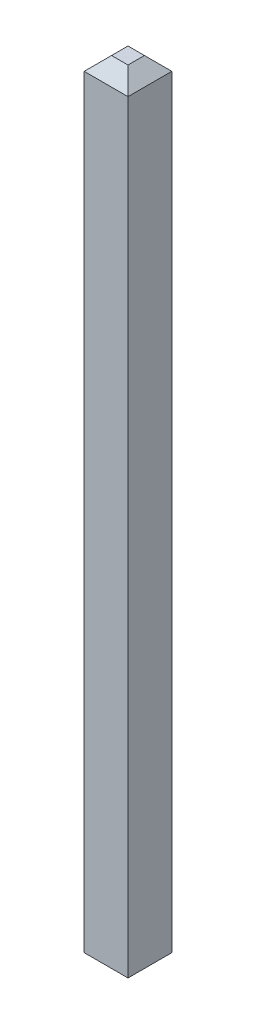
ISO-10303-21;
HEADER;
FILE_DESCRIPTION(('STEP AP214'),'2;1');
FILE_NAME('part.step','',(''),(''),'','','');
FILE_SCHEMA(('AUTOMOTIVE_DESIGN { 1 0 10303 214 1 1 1 1 }'));
ENDSEC;
DATA;
#1=APPLICATION_CONTEXT('core data for automotive mechanical design processes');
#2=APPLICATION_PROTOCOL_DEFINITION('international standard','automotive_design',2000,#1);
#3=PRODUCT_CONTEXT('',#1,'mechanical');
#4=PRODUCT('Part','Part','',(#3));
#5=PRODUCT_RELATED_PRODUCT_CATEGORY('part','',(#4));
#6=PRODUCT_DEFINITION_FORMATION('','',#4);
#7=PRODUCT_DEFINITION_CONTEXT('part definition',#1,'design');
#8=PRODUCT_DEFINITION('design','',#6,#7);
#9=PRODUCT_DEFINITION_SHAPE('','',#8);
#10=(LENGTH_UNIT() NAMED_UNIT(*) SI_UNIT(.MILLI.,.METRE.));
#11=(NAMED_UNIT(*) PLANE_ANGLE_UNIT() SI_UNIT($,.RADIAN.));
#12=(NAMED_UNIT(*) SI_UNIT($,.STERADIAN.) SOLID_ANGLE_UNIT());
#13=UNCERTAINTY_MEASURE_WITH_UNIT(LENGTH_MEASURE(1.E-05),#10,'distance_accuracy_value','');
#14=(GEOMETRIC_REPRESENTATION_CONTEXT(3) GLOBAL_UNCERTAINTY_ASSIGNED_CONTEXT((#13)) GLOBAL_UNIT_ASSIGNED_CONTEXT((#10,
#11,#12)) REPRESENTATION_CONTEXT('',''));
#15=CARTESIAN_POINT('',(0.,0.,0.));
#16=DIRECTION('',(0.,0.,1.));
#17=DIRECTION('',(1.,0.,0.));
#18=AXIS2_PLACEMENT_3D('',#15,#16,#17);
#19=CARTESIAN_POINT('',(6.47,-4.27,-0.32));
#20=DIRECTION('',(-0.707106781186548,0.707106781186548,0.));
#21=DIRECTION('',(-0.707106781186548,-0.707106781186548,0.));
#22=AXIS2_PLACEMENT_3D('',#19,#20,#21);
#23=PLANE('',#22);
#24=DIRECTION('',(0.,0.,1.));
#25=VECTOR('',#24,1.);
#26=CARTESIAN_POINT('',(6.67000000000001,-4.07,-0.32));
#27=LINE('',#26,#25);
#28=CARTESIAN_POINT('',(6.67,-4.07,-0.32));
#29=VERTEX_POINT('',#28);
#30=CARTESIAN_POINT('',(6.67,-4.07,0.32));
#31=VERTEX_POINT('',#30);
#32=EDGE_CURVE('E119',#29,#31,#27,.T.);
#33=ORIENTED_EDGE('',*,*,#32,.T.);
#34=DIRECTION('',(-0.577350269189626,-0.577350269189626,-0.577350269189626));
#35=VECTOR('',#34,1.);
#36=CARTESIAN_POINT('',(6.67,-4.07,0.32));
#37=LINE('',#36,#35);
#38=CARTESIAN_POINT('',(6.47,-4.27,0.12));
#39=VERTEX_POINT('',#38);
#40=EDGE_CURVE('E95',#31,#39,#37,.T.);
#41=ORIENTED_EDGE('',*,*,#40,.T.);
#42=DIRECTION('',(0.,0.,1.));
#43=VECTOR('',#42,1.);
#44=CARTESIAN_POINT('',(6.47,-4.27,-0.32));
#45=LINE('',#44,#43);
#46=CARTESIAN_POINT('',(6.47,-4.27,-0.12));
#47=VERTEX_POINT('',#46);
#48=EDGE_CURVE('E20',#39,#47,#45,.F.);
#49=ORIENTED_EDGE('',*,*,#48,.T.);
#50=DIRECTION('',(-0.577350269189626,-0.577350269189626,0.577350269189625));
#51=VECTOR('',#50,1.);
#52=CARTESIAN_POINT('',(6.67,-4.07,-0.32));
#53=LINE('',#52,#51);
#54=EDGE_CURVE('E84',#29,#47,#53,.T.);
#55=ORIENTED_EDGE('',*,*,#54,.F.);
#56=EDGE_LOOP('',(#33,#41,#49,#55));
#57=FACE_BOUND('',#56,.T.);
#58=ADVANCED_FACE('F17',(#57),#23,.F.);
#59=CARTESIAN_POINT('',(6.67,7.07,-0.32));
#60=DIRECTION('',(-0.707106781186548,-0.707106781186548,0.));
#61=DIRECTION('',(0.707106781186548,-0.707106781186548,0.));
#62=AXIS2_PLACEMENT_3D('',#59,#60,#61);
#63=PLANE('',#62);
#64=DIRECTION('',(0.,0.,1.));
#65=VECTOR('',#64,1.);
#66=CARTESIAN_POINT('',(6.67,7.07,-0.32));
#67=LINE('',#66,#65);
#68=CARTESIAN_POINT('',(6.67,7.07,0.32));
#69=VERTEX_POINT('',#68);
#70=CARTESIAN_POINT('',(6.67,7.07,-0.319999999999999));
#71=VERTEX_POINT('',#70);
#72=EDGE_CURVE('E121',#69,#71,#67,.F.);
#73=ORIENTED_EDGE('',*,*,#72,.T.);
#74=DIRECTION('',(0.577350269189627,-0.577350269189627,-0.577350269189624));
#75=VECTOR('',#74,1.);
#76=CARTESIAN_POINT('',(6.47,7.27,-0.12));
#77=LINE('',#76,#75);
#78=CARTESIAN_POINT('',(6.47,7.27,-0.12));
#79=VERTEX_POINT('',#78);
#80=EDGE_CURVE('E78',#79,#71,#77,.T.);
#81=ORIENTED_EDGE('',*,*,#80,.F.);
#82=DIRECTION('',(0.,0.,1.));
#83=VECTOR('',#82,1.);
#84=CARTESIAN_POINT('',(6.47,7.27,-0.32));
#85=LINE('',#84,#83);
#86=CARTESIAN_POINT('',(6.47,7.27,0.12));
#87=VERTEX_POINT('',#86);
#88=EDGE_CURVE('E108',#79,#87,#85,.T.);
#89=ORIENTED_EDGE('',*,*,#88,.T.);
#90=DIRECTION('',(0.577350269189627,-0.577350269189627,0.577350269189624));
#91=VECTOR('',#90,1.);
#92=CARTESIAN_POINT('',(6.47,7.27,0.119999999999999));
#93=LINE('',#92,#91);
#94=EDGE_CURVE('E116',#87,#69,#93,.T.);
#95=ORIENTED_EDGE('',*,*,#94,.T.);
#96=EDGE_LOOP('',(#73,#81,#89,#95));
#97=FACE_BOUND('',#96,.T.);
#98=ADVANCED_FACE('F214',(#97),#63,.F.);
#99=CARTESIAN_POINT('',(6.67,-4.27,-0.32));
#100=DIRECTION('',(0.,1.,0.));
#101=DIRECTION('',(0.,0.,1.));
#102=AXIS2_PLACEMENT_3D('',#99,#100,#101);
#103=PLANE('',#102);
#104=DIRECTION('',(1.,0.,0.));
#105=VECTOR('',#104,1.);
#106=CARTESIAN_POINT('',(6.67,-4.27,0.12));
#107=LINE('',#106,#105);
#108=CARTESIAN_POINT('',(6.23,-4.27,0.12));
#109=VERTEX_POINT('',#108);
#110=EDGE_CURVE('E110',#39,#109,#107,.F.);
#111=ORIENTED_EDGE('',*,*,#110,.T.);
#112=DIRECTION('',(0.,0.,1.));
#113=VECTOR('',#112,1.);
#114=CARTESIAN_POINT('',(6.23,-4.27,-0.32));
#115=LINE('',#114,#113);
#116=CARTESIAN_POINT('',(6.23,-4.27,-0.12));
#117=VERTEX_POINT('',#116);
#118=EDGE_CURVE('E101',#109,#117,#115,.F.);
#119=ORIENTED_EDGE('',*,*,#118,.T.);
#120=DIRECTION('',(1.,0.,0.));
#121=VECTOR('',#120,1.);
#122=CARTESIAN_POINT('',(6.35,-4.27,-0.12));
#123=LINE('',#122,#121);
#124=EDGE_CURVE('E89',#47,#117,#123,.F.);
#125=ORIENTED_EDGE('',*,*,#124,.F.);
#126=ORIENTED_EDGE('',*,*,#48,.F.);
#127=EDGE_LOOP('',(#111,#119,#125,#126));
#128=FACE_BOUND('',#127,.T.);
#129=ADVANCED_FACE('F99',(#128),#103,.F.);
#130=CARTESIAN_POINT('',(6.35,-4.07,-0.32));
#131=DIRECTION('',(0.,-0.707106781186548,-0.707106781186548));
#132=DIRECTION('',(0.,0.707106781186548,-0.707106781186548));
#133=AXIS2_PLACEMENT_3D('',#130,#131,#132);
#134=PLANE('',#133);
#135=ORIENTED_EDGE('',*,*,#54,.T.);
#136=ORIENTED_EDGE('',*,*,#124,.T.);
#137=DIRECTION('',(-0.577350269189625,0.577350269189625,-0.577350269189627));
#138=VECTOR('',#137,1.);
#139=CARTESIAN_POINT('',(6.23,-4.27,-0.12));
#140=LINE('',#139,#138);
#141=CARTESIAN_POINT('',(6.03,-4.07,-0.32));
#142=VERTEX_POINT('',#141);
#143=EDGE_CURVE('E127',#117,#142,#140,.T.);
#144=ORIENTED_EDGE('',*,*,#143,.T.);
#145=DIRECTION('',(-1.,0.,0.));
#146=VECTOR('',#145,1.);
#147=CARTESIAN_POINT('',(6.35,-4.07,-0.320000000000001));
#148=LINE('',#147,#146);
#149=EDGE_CURVE('E91',#29,#142,#148,.T.);
#150=ORIENTED_EDGE('',*,*,#149,.F.);
#151=EDGE_LOOP('',(#135,#136,#144,#150));
#152=FACE_BOUND('',#151,.T.);
#153=ADVANCED_FACE('F86',(#152),#134,.T.);
#154=CARTESIAN_POINT('',(6.35,7.07,-0.32));
#155=DIRECTION('',(0.,0.707106781186548,-0.707106781186548));
#156=DIRECTION('',(0.,0.707106781186548,0.707106781186548));
#157=AXIS2_PLACEMENT_3D('',#154,#155,#156);
#158=PLANE('',#157);
#159=ORIENTED_EDGE('',*,*,#80,.T.);
#160=DIRECTION('',(-1.,0.,0.));
#161=VECTOR('',#160,1.);
#162=CARTESIAN_POINT('',(6.35,7.07,-0.319999999999999));
#163=LINE('',#162,#161);
#164=CARTESIAN_POINT('',(6.03,7.07,-0.32));
#165=VERTEX_POINT('',#164);
#166=EDGE_CURVE('E129',#165,#71,#163,.F.);
#167=ORIENTED_EDGE('',*,*,#166,.F.);
#168=DIRECTION('',(0.577350269189625,0.577350269189625,0.577350269189627));
#169=VECTOR('',#168,1.);
#170=CARTESIAN_POINT('',(6.03,7.07,-0.32));
#171=LINE('',#170,#169);
#172=CARTESIAN_POINT('',(6.23,7.27,-0.120000000000001));
#173=VERTEX_POINT('',#172);
#174=EDGE_CURVE('E136',#165,#173,#171,.T.);
#175=ORIENTED_EDGE('',*,*,#174,.T.);
#176=DIRECTION('',(1.,0.,0.));
#177=VECTOR('',#176,1.);
#178=CARTESIAN_POINT('',(6.03,7.27,-0.12));
#179=LINE('',#178,#177);
#180=EDGE_CURVE('E103',#173,#79,#179,.T.);
#181=ORIENTED_EDGE('',*,*,#180,.T.);
#182=EDGE_LOOP('',(#159,#167,#175,#181));
#183=FACE_BOUND('',#182,.T.);
#184=ADVANCED_FACE('F206',(#183),#158,.T.);
#185=CARTESIAN_POINT('',(6.03,7.27,-0.32));
#186=DIRECTION('',(0.,-1.,0.));
#187=DIRECTION('',(1.,0.,0.));
#188=AXIS2_PLACEMENT_3D('',#185,#186,#187);
#189=PLANE('',#188);
#190=ORIENTED_EDGE('',*,*,#180,.F.);
#191=DIRECTION('',(0.,0.,1.));
#192=VECTOR('',#191,1.);
#193=CARTESIAN_POINT('',(6.23,7.27,-0.32));
#194=LINE('',#193,#192);
#195=CARTESIAN_POINT('',(6.23,7.27,0.12));
#196=VERTEX_POINT('',#195);
#197=EDGE_CURVE('E139',#173,#196,#194,.T.);
#198=ORIENTED_EDGE('',*,*,#197,.T.);
#199=DIRECTION('',(1.,0.,0.));
#200=VECTOR('',#199,1.);
#201=CARTESIAN_POINT('',(6.03,7.27,0.12));
#202=LINE('',#201,#200);
#203=EDGE_CURVE('E113',#196,#87,#202,.T.);
#204=ORIENTED_EDGE('',*,*,#203,.T.);
#205=ORIENTED_EDGE('',*,*,#88,.F.);
#206=EDGE_LOOP('',(#190,#198,#204,#205));
#207=FACE_BOUND('',#206,.T.);
#208=ADVANCED_FACE('F203',(#207),#189,.F.);
#209=CARTESIAN_POINT('',(6.67,-4.27,0.12));
#210=DIRECTION('',(0.,0.707106781186548,-0.707106781186548));
#211=DIRECTION('',(0.,0.707106781186548,0.707106781186548));
#212=AXIS2_PLACEMENT_3D('',#209,#210,#211);
#213=PLANE('',#212);
#214=DIRECTION('',(-1.,0.,0.));
#215=VECTOR('',#214,1.);
#216=CARTESIAN_POINT('',(6.35,-4.07,0.319999999999999));
#217=LINE('',#216,#215);
#218=CARTESIAN_POINT('',(6.03,-4.07,0.32));
#219=VERTEX_POINT('',#218);
#220=EDGE_CURVE('E144',#31,#219,#217,.T.);
#221=ORIENTED_EDGE('',*,*,#220,.T.);
#222=DIRECTION('',(0.577350269189625,-0.577350269189625,-0.577350269189627));
#223=VECTOR('',#222,1.);
#224=CARTESIAN_POINT('',(6.03,-4.07,0.32));
#225=LINE('',#224,#223);
#226=EDGE_CURVE('E123',#219,#109,#225,.T.);
#227=ORIENTED_EDGE('',*,*,#226,.T.);
#228=ORIENTED_EDGE('',*,*,#110,.F.);
#229=ORIENTED_EDGE('',*,*,#40,.F.);
#230=EDGE_LOOP('',(#221,#227,#228,#229));
#231=FACE_BOUND('',#230,.T.);
#232=ADVANCED_FACE('F176',(#231),#213,.F.);
#233=CARTESIAN_POINT('',(6.03,7.27,0.12));
#234=DIRECTION('',(0.,-0.707106781186548,-0.707106781186548));
#235=DIRECTION('',(0.,0.707106781186548,-0.707106781186548));
#236=AXIS2_PLACEMENT_3D('',#233,#234,#235);
#237=PLANE('',#236);
#238=ORIENTED_EDGE('',*,*,#203,.F.);
#239=DIRECTION('',(-0.577350269189625,-0.577350269189625,0.577350269189627));
#240=VECTOR('',#239,1.);
#241=CARTESIAN_POINT('',(6.23,7.27,0.12));
#242=LINE('',#241,#240);
#243=CARTESIAN_POINT('',(6.03,7.07,0.32));
#244=VERTEX_POINT('',#243);
#245=EDGE_CURVE('E142',#196,#244,#242,.T.);
#246=ORIENTED_EDGE('',*,*,#245,.T.);
#247=DIRECTION('',(-1.,0.,0.));
#248=VECTOR('',#247,1.);
#249=CARTESIAN_POINT('',(6.35,7.07,0.320000000000001));
#250=LINE('',#249,#248);
#251=EDGE_CURVE('E34',#244,#69,#250,.F.);
#252=ORIENTED_EDGE('',*,*,#251,.T.);
#253=ORIENTED_EDGE('',*,*,#94,.F.);
#254=EDGE_LOOP('',(#238,#246,#252,#253));
#255=FACE_BOUND('',#254,.T.);
#256=ADVANCED_FACE('F196',(#255),#237,.F.);
#257=CARTESIAN_POINT('',(6.67,7.27,-0.32));
#258=DIRECTION('',(-1.,0.,0.));
#259=DIRECTION('',(0.,-1.,0.));
#260=AXIS2_PLACEMENT_3D('',#257,#258,#259);
#261=PLANE('',#260);
#262=ORIENTED_EDGE('',*,*,#72,.F.);
#263=DIRECTION('',(0.,1.,0.));
#264=VECTOR('',#263,1.);
#265=CARTESIAN_POINT('',(6.67,1.5,0.32));
#266=LINE('',#265,#264);
#267=EDGE_CURVE('E148',#69,#31,#266,.F.);
#268=ORIENTED_EDGE('',*,*,#267,.T.);
#269=ORIENTED_EDGE('',*,*,#32,.F.);
#270=DIRECTION('',(0.,1.,0.));
#271=VECTOR('',#270,1.);
#272=CARTESIAN_POINT('',(6.67,1.5,-0.32));
#273=LINE('',#272,#271);
#274=EDGE_CURVE('E132',#71,#29,#273,.F.);
#275=ORIENTED_EDGE('',*,*,#274,.F.);
#276=EDGE_LOOP('',(#262,#268,#269,#275));
#277=FACE_BOUND('',#276,.T.);
#278=ADVANCED_FACE('F193',(#277),#261,.F.);
#279=CARTESIAN_POINT('',(6.03,-4.07,-0.32));
#280=DIRECTION('',(0.707106781186548,0.707106781186548,0.));
#281=DIRECTION('',(-0.707106781186548,0.707106781186548,0.));
#282=AXIS2_PLACEMENT_3D('',#279,#280,#281);
#283=PLANE('',#282);
#284=ORIENTED_EDGE('',*,*,#118,.F.);
#285=ORIENTED_EDGE('',*,*,#226,.F.);
#286=DIRECTION('',(0.,0.,-1.));
#287=VECTOR('',#286,1.);
#288=CARTESIAN_POINT('',(6.03,-4.07,-0.32));
#289=LINE('',#288,#287);
#290=EDGE_CURVE('E151',#219,#142,#289,.T.);
#291=ORIENTED_EDGE('',*,*,#290,.T.);
#292=ORIENTED_EDGE('',*,*,#143,.F.);
#293=EDGE_LOOP('',(#284,#285,#291,#292));
#294=FACE_BOUND('',#293,.T.);
#295=ADVANCED_FACE('F173',(#294),#283,.F.);
#296=CARTESIAN_POINT('',(6.35,1.5,-0.32));
#297=DIRECTION('',(0.,0.,-1.));
#298=DIRECTION('',(-1.,0.,0.));
#299=AXIS2_PLACEMENT_3D('',#296,#297,#298);
#300=PLANE('',#299);
#301=ORIENTED_EDGE('',*,*,#274,.T.);
#302=ORIENTED_EDGE('',*,*,#149,.T.);
#303=DIRECTION('',(0.,1.,0.));
#304=VECTOR('',#303,1.);
#305=CARTESIAN_POINT('',(6.03,-4.27,-0.32));
#306=LINE('',#305,#304);
#307=EDGE_CURVE('E154',#142,#165,#306,.T.);
#308=ORIENTED_EDGE('',*,*,#307,.T.);
#309=ORIENTED_EDGE('',*,*,#166,.T.);
#310=EDGE_LOOP('',(#301,#302,#308,#309));
#311=FACE_BOUND('',#310,.T.);
#312=ADVANCED_FACE('F170',(#311),#300,.T.);
#313=CARTESIAN_POINT('',(6.23,7.27,-0.32));
#314=DIRECTION('',(0.707106781186548,-0.707106781186548,0.));
#315=DIRECTION('',(0.707106781186548,0.707106781186548,0.));
#316=AXIS2_PLACEMENT_3D('',#313,#314,#315);
#317=PLANE('',#316);
#318=ORIENTED_EDGE('',*,*,#197,.F.);
#319=ORIENTED_EDGE('',*,*,#174,.F.);
#320=DIRECTION('',(0.,0.,-1.));
#321=VECTOR('',#320,1.);
#322=CARTESIAN_POINT('',(6.03,7.07,-0.32));
#323=LINE('',#322,#321);
#324=EDGE_CURVE('E26',#165,#244,#323,.F.);
#325=ORIENTED_EDGE('',*,*,#324,.T.);
#326=ORIENTED_EDGE('',*,*,#245,.F.);
#327=EDGE_LOOP('',(#318,#319,#325,#326));
#328=FACE_BOUND('',#327,.T.);
#329=ADVANCED_FACE('F162',(#328),#317,.F.);
#330=CARTESIAN_POINT('',(6.35,1.5,0.32));
#331=DIRECTION('',(0.,0.,-1.));
#332=DIRECTION('',(-1.,0.,0.));
#333=AXIS2_PLACEMENT_3D('',#330,#331,#332);
#334=PLANE('',#333);
#335=ORIENTED_EDGE('',*,*,#251,.F.);
#336=DIRECTION('',(0.,1.,0.));
#337=VECTOR('',#336,1.);
#338=CARTESIAN_POINT('',(6.03,-4.27,0.32));
#339=LINE('',#338,#337);
#340=EDGE_CURVE('E11',#244,#219,#339,.F.);
#341=ORIENTED_EDGE('',*,*,#340,.T.);
#342=ORIENTED_EDGE('',*,*,#220,.F.);
#343=ORIENTED_EDGE('',*,*,#267,.F.);
#344=EDGE_LOOP('',(#335,#341,#342,#343));
#345=FACE_BOUND('',#344,.T.);
#346=ADVANCED_FACE('F177',(#345),#334,.F.);
#347=CARTESIAN_POINT('',(6.03,-4.27,-0.32));
#348=DIRECTION('',(1.,0.,0.));
#349=DIRECTION('',(0.,0.,-1.));
#350=AXIS2_PLACEMENT_3D('',#347,#348,#349);
#351=PLANE('',#350);
#352=ORIENTED_EDGE('',*,*,#324,.F.);
#353=ORIENTED_EDGE('',*,*,#307,.F.);
#354=ORIENTED_EDGE('',*,*,#290,.F.);
#355=ORIENTED_EDGE('',*,*,#340,.F.);
#356=EDGE_LOOP('',(#352,#353,#354,#355));
#357=FACE_BOUND('',#356,.T.);
#358=ADVANCED_FACE('F167',(#357),#351,.F.);
#359=CLOSED_SHELL('',(#58,#98,#129,#153,#184,#208,#232,#256,#278,#295,#312,#329,#346,#358));
#360=MANIFOLD_SOLID_BREP('B1',#359);
#361=ADVANCED_BREP_SHAPE_REPRESENTATION('',(#18,#360),#14);
#362=SHAPE_DEFINITION_REPRESENTATION(#9,#361);
ENDSEC;
END-ISO-10303-21;
